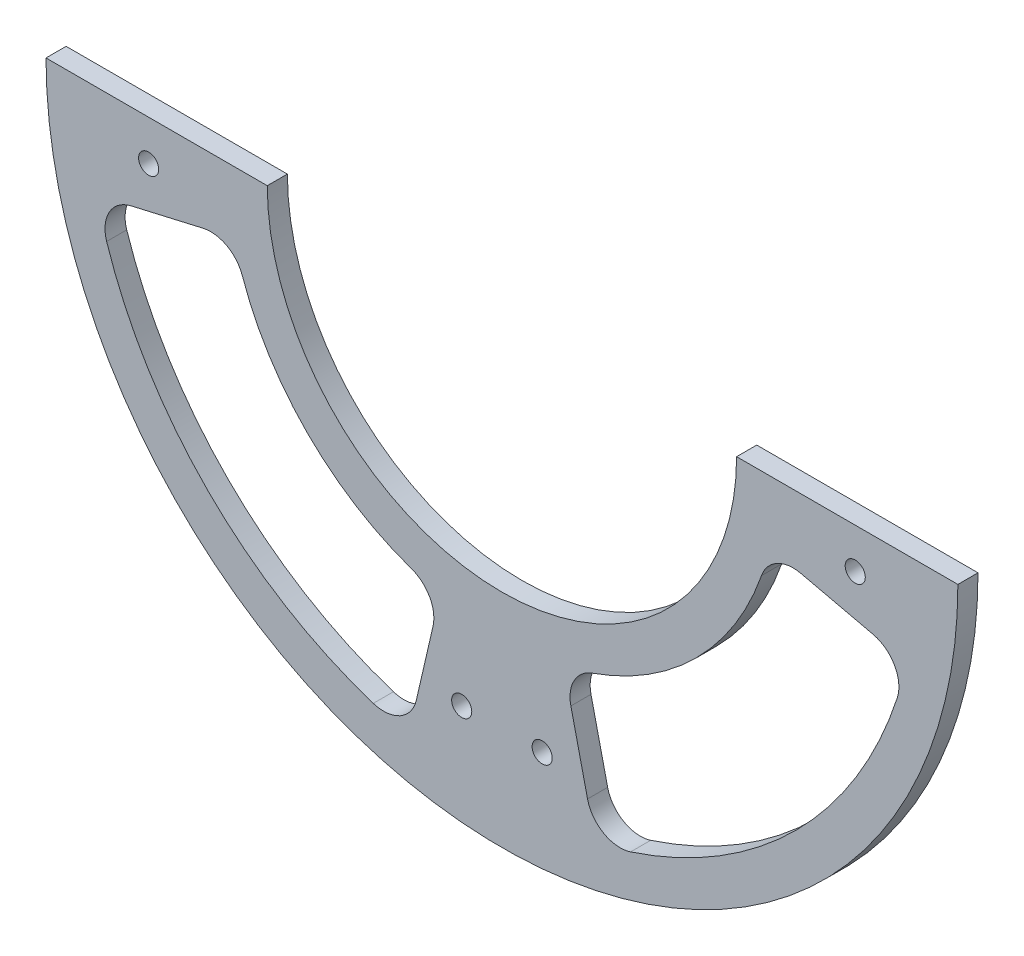
ISO-10303-21;
HEADER;
FILE_DESCRIPTION(('STEP AP214'),'2;1');
FILE_NAME('part.step','',(''),(''),'','','');
FILE_SCHEMA(('AUTOMOTIVE_DESIGN { 1 0 10303 214 1 1 1 1 }'));
ENDSEC;
DATA;
#1=APPLICATION_CONTEXT('core data for automotive mechanical design processes');
#2=APPLICATION_PROTOCOL_DEFINITION('international standard','automotive_design',2000,#1);
#3=PRODUCT_CONTEXT('',#1,'mechanical');
#4=PRODUCT('Part','Part','',(#3));
#5=PRODUCT_RELATED_PRODUCT_CATEGORY('part','',(#4));
#6=PRODUCT_DEFINITION_FORMATION('','',#4);
#7=PRODUCT_DEFINITION_CONTEXT('part definition',#1,'design');
#8=PRODUCT_DEFINITION('design','',#6,#7);
#9=PRODUCT_DEFINITION_SHAPE('','',#8);
#10=(LENGTH_UNIT() NAMED_UNIT(*) SI_UNIT(.MILLI.,.METRE.));
#11=(NAMED_UNIT(*) PLANE_ANGLE_UNIT() SI_UNIT($,.RADIAN.));
#12=(NAMED_UNIT(*) SI_UNIT($,.STERADIAN.) SOLID_ANGLE_UNIT());
#13=UNCERTAINTY_MEASURE_WITH_UNIT(LENGTH_MEASURE(1.E-05),#10,'distance_accuracy_value','');
#14=(GEOMETRIC_REPRESENTATION_CONTEXT(3) GLOBAL_UNCERTAINTY_ASSIGNED_CONTEXT((#13)) GLOBAL_UNIT_ASSIGNED_CONTEXT((#10,
#11,#12)) REPRESENTATION_CONTEXT('',''));
#15=CARTESIAN_POINT('',(0.,0.,0.));
#16=DIRECTION('',(0.,0.,1.));
#17=DIRECTION('',(1.,0.,0.));
#18=AXIS2_PLACEMENT_3D('',#15,#16,#17);
#19=CARTESIAN_POINT('',(1.10140146269985,2.65337625104963,3.));
#20=DIRECTION('',(0.,0.,1.));
#21=DIRECTION('',(1.,0.,0.));
#22=AXIS2_PLACEMENT_3D('',#19,#20,#21);
#23=PLANE('',#22);
#24=CARTESIAN_POINT('',(1.10140146269985,2.65337625104963,3.));
#25=DIRECTION('',(0.,0.,-1.));
#26=DIRECTION('',(1.,0.,0.));
#27=AXIS2_PLACEMENT_3D('',#24,#25,#26);
#28=CIRCLE('',#27,41.);
#29=CARTESIAN_POINT('',(39.8130026100056,-10.852620069545,3.));
#30=VERTEX_POINT('',#29);
#31=CARTESIAN_POINT('',(14.6073977832945,-36.0582248962561,3.));
#32=VERTEX_POINT('',#31);
#33=EDGE_CURVE('E439',#30,#32,#28,.T.);
#34=ORIENTED_EDGE('',*,*,#33,.F.);
#35=CARTESIAN_POINT('',(44.5339295791893,-12.4996927915687,3.));
#36=DIRECTION('',(0.,0.,1.));
#37=DIRECTION('',(1.,0.,0.));
#38=AXIS2_PLACEMENT_3D('',#35,#36,#37);
#39=CIRCLE('',#38,5.);
#40=CARTESIAN_POINT('',(45.6580992834676,-7.62770731581216,3.));
#41=VERTEX_POINT('',#40);
#42=EDGE_CURVE('E241',#30,#41,#39,.F.);
#43=ORIENTED_EDGE('',*,*,#42,.T.);
#44=DIRECTION('',(-0.974397095151311,0.22483394085566,0.));
#45=VECTOR('',#44,1.);
#46=CARTESIAN_POINT('',(41.0516823639036,-6.56481532403244,3.));
#47=LINE('',#46,#45);
#48=CARTESIAN_POINT('',(56.4279396672789,-10.1127574744467,3.));
#49=VERTEX_POINT('',#48);
#50=EDGE_CURVE('E415',#49,#41,#47,.T.);
#51=ORIENTED_EDGE('',*,*,#50,.F.);
#52=CARTESIAN_POINT('',(55.3037699630006,-14.9847429502032,3.));
#53=DIRECTION('',(0.,0.,1.));
#54=DIRECTION('',(1.,0.,0.));
#55=AXIS2_PLACEMENT_3D('',#52,#53,#54);
#56=CIRCLE('',#55,5.);
#57=CARTESIAN_POINT('',(60.0583636910972,-16.5319463889096,3.));
#58=VERTEX_POINT('',#57);
#59=EDGE_CURVE('E245',#49,#58,#56,.F.);
#60=ORIENTED_EDGE('',*,*,#59,.T.);
#61=CARTESIAN_POINT('',(1.10140146269985,2.65337625104963,3.));
#62=DIRECTION('',(0.,0.,1.));
#63=DIRECTION('',(1.,0.,0.));
#64=AXIS2_PLACEMENT_3D('',#61,#62,#63);
#65=CIRCLE('',#64,62.);
#66=CARTESIAN_POINT('',(20.2867241026591,-56.3035859773477,3.));
#67=VERTEX_POINT('',#66);
#68=EDGE_CURVE('E421',#67,#58,#65,.T.);
#69=ORIENTED_EDGE('',*,*,#68,.F.);
#70=CARTESIAN_POINT('',(18.7395206639527,-51.5489922492511,3.));
#71=DIRECTION('',(0.,0.,1.));
#72=DIRECTION('',(1.,0.,0.));
#73=AXIS2_PLACEMENT_3D('',#70,#71,#72);
#74=CIRCLE('',#73,5.);
#75=CARTESIAN_POINT('',(13.8675351881961,-52.6731619535294,3.));
#76=VERTEX_POINT('',#75);
#77=EDGE_CURVE('E249',#67,#76,#74,.F.);
#78=ORIENTED_EDGE('',*,*,#77,.T.);
#79=DIRECTION('',(0.22483394085566,-0.974397095151311,0.));
#80=VECTOR('',#79,1.);
#81=CARTESIAN_POINT('',(10.3195930377819,-37.2969046501541,3.));
#82=LINE('',#81,#80);
#83=CARTESIAN_POINT('',(11.3824850295616,-41.9033215697181,3.));
#84=VERTEX_POINT('',#83);
#85=EDGE_CURVE('E441',#84,#76,#82,.T.);
#86=ORIENTED_EDGE('',*,*,#85,.F.);
#87=CARTESIAN_POINT('',(16.2544705053182,-40.7791518654398,3.));
#88=DIRECTION('',(0.,0.,1.));
#89=DIRECTION('',(1.,0.,0.));
#90=AXIS2_PLACEMENT_3D('',#87,#88,#89);
#91=CIRCLE('',#90,5.);
#92=EDGE_CURVE('E253',#84,#32,#91,.F.);
#93=ORIENTED_EDGE('',*,*,#92,.T.);
#94=EDGE_LOOP('',(#34,#43,#51,#60,#69,#78,#86,#93));
#95=FACE_BOUND('',#94,.T.);
#96=CARTESIAN_POINT('',(1.10140146269985,2.65337625104963,3.));
#97=DIRECTION('',(0.,0.,-1.));
#98=DIRECTION('',(1.,0.,0.));
#99=AXIS2_PLACEMENT_3D('',#96,#97,#98);
#100=CIRCLE('',#99,41.);
#101=CARTESIAN_POINT('',(-12.4045948578948,-36.0582248962561,3.));
#102=VERTEX_POINT('',#101);
#103=CARTESIAN_POINT('',(-37.6101996846059,-10.852620069545,3.));
#104=VERTEX_POINT('',#103);
#105=EDGE_CURVE('E273',#102,#104,#100,.T.);
#106=ORIENTED_EDGE('',*,*,#105,.F.);
#107=CARTESIAN_POINT('',(-14.0516675799185,-40.7791518654398,3.));
#108=DIRECTION('',(0.,0.,1.));
#109=DIRECTION('',(1.,0.,0.));
#110=AXIS2_PLACEMENT_3D('',#107,#108,#109);
#111=CIRCLE('',#110,5.);
#112=CARTESIAN_POINT('',(-9.17968210416194,-41.9033215697181,3.));
#113=VERTEX_POINT('',#112);
#114=EDGE_CURVE('E261',#102,#113,#111,.F.);
#115=ORIENTED_EDGE('',*,*,#114,.T.);
#116=DIRECTION('',(0.22483394085566,0.974397095151311,0.));
#117=VECTOR('',#116,1.);
#118=CARTESIAN_POINT('',(-8.11679011238222,-37.2969046501541,3.));
#119=LINE('',#118,#117);
#120=CARTESIAN_POINT('',(-11.6647322627964,-52.6731619535294,3.));
#121=VERTEX_POINT('',#120);
#122=EDGE_CURVE('E293',#121,#113,#119,.T.);
#123=ORIENTED_EDGE('',*,*,#122,.F.);
#124=CARTESIAN_POINT('',(-16.536717738553,-51.5489922492511,3.));
#125=DIRECTION('',(0.,0.,1.));
#126=DIRECTION('',(1.,0.,0.));
#127=AXIS2_PLACEMENT_3D('',#124,#125,#126);
#128=CIRCLE('',#127,5.);
#129=CARTESIAN_POINT('',(-18.0839211772594,-56.3035859773477,3.));
#130=VERTEX_POINT('',#129);
#131=EDGE_CURVE('E257',#121,#130,#128,.F.);
#132=ORIENTED_EDGE('',*,*,#131,.T.);
#133=CARTESIAN_POINT('',(1.10140146269985,2.65337625104963,3.));
#134=DIRECTION('',(0.,0.,1.));
#135=DIRECTION('',(1.,0.,0.));
#136=AXIS2_PLACEMENT_3D('',#133,#134,#135);
#137=CIRCLE('',#136,62.);
#138=CARTESIAN_POINT('',(-57.8555607656975,-16.5319463889096,3.));
#139=VERTEX_POINT('',#138);
#140=EDGE_CURVE('E301',#139,#130,#137,.T.);
#141=ORIENTED_EDGE('',*,*,#140,.F.);
#142=CARTESIAN_POINT('',(-53.1009670376009,-14.9847429502032,3.));
#143=DIRECTION('',(0.,0.,1.));
#144=DIRECTION('',(1.,0.,0.));
#145=AXIS2_PLACEMENT_3D('',#142,#143,#144);
#146=CIRCLE('',#145,5.);
#147=CARTESIAN_POINT('',(-54.2251367418792,-10.1127574744467,3.));
#148=VERTEX_POINT('',#147);
#149=EDGE_CURVE('E265',#139,#148,#146,.F.);
#150=ORIENTED_EDGE('',*,*,#149,.T.);
#151=DIRECTION('',(-0.974397095151311,-0.22483394085566,0.));
#152=VECTOR('',#151,1.);
#153=CARTESIAN_POINT('',(-38.8488794385039,-6.56481532403245,3.));
#154=LINE('',#153,#152);
#155=CARTESIAN_POINT('',(-43.4552963580678,-7.62770731581217,3.));
#156=VERTEX_POINT('',#155);
#157=EDGE_CURVE('E274',#156,#148,#154,.T.);
#158=ORIENTED_EDGE('',*,*,#157,.F.);
#159=CARTESIAN_POINT('',(-42.3311266537895,-12.4996927915687,3.));
#160=DIRECTION('',(0.,0.,1.));
#161=DIRECTION('',(1.,0.,0.));
#162=AXIS2_PLACEMENT_3D('',#159,#160,#161);
#163=CIRCLE('',#162,5.);
#164=EDGE_CURVE('E43',#156,#104,#163,.F.);
#165=ORIENTED_EDGE('',*,*,#164,.T.);
#166=EDGE_LOOP('',(#106,#115,#123,#132,#141,#150,#158,#165));
#167=FACE_BOUND('',#166,.T.);
#168=CARTESIAN_POINT('',(7.10140146269986,-50.0360999277852,3.));
#169=DIRECTION('',(0.,0.,1.));
#170=DIRECTION('',(1.,0.,0.));
#171=AXIS2_PLACEMENT_3D('',#168,#169,#170);
#172=CIRCLE('',#171,1.5);
#173=CARTESIAN_POINT('',(8.60140146269986,-50.0360999277852,3.));
#174=VERTEX_POINT('',#173);
#175=EDGE_CURVE('E312',#174,#174,#172,.T.);
#176=ORIENTED_EDGE('',*,*,#175,.F.);
#177=EDGE_LOOP('',(#176));
#178=FACE_BOUND('',#177,.T.);
#179=CARTESIAN_POINT('',(-51.5880747161349,-3.34662374895037,3.));
#180=DIRECTION('',(0.,0.,1.));
#181=DIRECTION('',(1.,0.,0.));
#182=AXIS2_PLACEMENT_3D('',#179,#180,#181);
#183=CIRCLE('',#182,1.5);
#184=CARTESIAN_POINT('',(-50.0880747161349,-3.34662374895037,3.));
#185=VERTEX_POINT('',#184);
#186=EDGE_CURVE('E324',#185,#185,#183,.T.);
#187=ORIENTED_EDGE('',*,*,#186,.F.);
#188=EDGE_LOOP('',(#187));
#189=FACE_BOUND('',#188,.T.);
#190=CARTESIAN_POINT('',(1.10140146269985,2.65337625104963,3.));
#191=DIRECTION('',(0.,0.,-1.));
#192=DIRECTION('',(1.,0.,0.));
#193=AXIS2_PLACEMENT_3D('',#190,#191,#192);
#194=CIRCLE('',#193,35.);
#195=CARTESIAN_POINT('',(36.1014014626999,2.65337625104963,3.));
#196=VERTEX_POINT('',#195);
#197=CARTESIAN_POINT('',(-33.8985985373002,2.65337625104963,3.));
#198=VERTEX_POINT('',#197);
#199=EDGE_CURVE('E183',#196,#198,#194,.T.);
#200=ORIENTED_EDGE('',*,*,#199,.T.);
#201=DIRECTION('',(-1.,0.,0.));
#202=VECTOR('',#201,1.);
#203=CARTESIAN_POINT('',(-66.8985985373001,2.65337625104963,3.));
#204=LINE('',#203,#202);
#205=CARTESIAN_POINT('',(-66.8985985373001,2.65337625104964,3.));
#206=VERTEX_POINT('',#205);
#207=EDGE_CURVE('E172',#198,#206,#204,.T.);
#208=ORIENTED_EDGE('',*,*,#207,.T.);
#209=CARTESIAN_POINT('',(1.10140146269985,2.65337625104963,3.));
#210=DIRECTION('',(0.,0.,1.));
#211=DIRECTION('',(1.,0.,0.));
#212=AXIS2_PLACEMENT_3D('',#209,#210,#211);
#213=CIRCLE('',#212,68.);
#214=CARTESIAN_POINT('',(69.1014014626999,2.65337625104963,3.));
#215=VERTEX_POINT('',#214);
#216=EDGE_CURVE('E182',#206,#215,#213,.T.);
#217=ORIENTED_EDGE('',*,*,#216,.T.);
#218=DIRECTION('',(-1.,0.,0.));
#219=VECTOR('',#218,1.);
#220=CARTESIAN_POINT('',(36.1014014626999,2.65337625104963,3.));
#221=LINE('',#220,#219);
#222=EDGE_CURVE('E188',#215,#196,#221,.T.);
#223=ORIENTED_EDGE('',*,*,#222,.T.);
#224=EDGE_LOOP('',(#200,#208,#217,#223));
#225=FACE_BOUND('',#224,.T.);
#226=CARTESIAN_POINT('',(-4.89859853730014,-50.0360999277852,3.));
#227=DIRECTION('',(0.,0.,1.));
#228=DIRECTION('',(1.,0.,0.));
#229=AXIS2_PLACEMENT_3D('',#226,#227,#228);
#230=CIRCLE('',#229,1.5);
#231=CARTESIAN_POINT('',(-3.39859853730014,-50.0360999277852,3.));
#232=VERTEX_POINT('',#231);
#233=EDGE_CURVE('E318',#232,#232,#230,.T.);
#234=ORIENTED_EDGE('',*,*,#233,.F.);
#235=EDGE_LOOP('',(#234));
#236=FACE_BOUND('',#235,.T.);
#237=CARTESIAN_POINT('',(53.7908776415346,-3.34662374895037,3.));
#238=DIRECTION('',(0.,0.,1.));
#239=DIRECTION('',(1.,0.,0.));
#240=AXIS2_PLACEMENT_3D('',#237,#238,#239);
#241=CIRCLE('',#240,1.5);
#242=CARTESIAN_POINT('',(55.2908776415347,-3.34662374895037,3.));
#243=VERTEX_POINT('',#242);
#244=EDGE_CURVE('E306',#243,#243,#241,.T.);
#245=ORIENTED_EDGE('',*,*,#244,.F.);
#246=EDGE_LOOP('',(#245));
#247=FACE_BOUND('',#246,.T.);
#248=ADVANCED_FACE('F35',(#95,#167,#178,#189,#225,#236,#247),#23,.T.);
#249=CARTESIAN_POINT('',(1.10140146269985,2.65337625104963,0.));
#250=DIRECTION('',(0.,0.,1.));
#251=DIRECTION('',(1.,0.,0.));
#252=AXIS2_PLACEMENT_3D('',#249,#250,#251);
#253=PLANE('',#252);
#254=CARTESIAN_POINT('',(1.10140146269985,2.65337625104963,0.));
#255=DIRECTION('',(0.,0.,1.));
#256=DIRECTION('',(1.,0.,0.));
#257=AXIS2_PLACEMENT_3D('',#254,#255,#256);
#258=CIRCLE('',#257,62.);
#259=CARTESIAN_POINT('',(20.2867241026591,-56.3035859773477,0.));
#260=VERTEX_POINT('',#259);
#261=CARTESIAN_POINT('',(60.0583636910972,-16.5319463889096,0.));
#262=VERTEX_POINT('',#261);
#263=EDGE_CURVE('E434',#260,#262,#258,.T.);
#264=ORIENTED_EDGE('',*,*,#263,.T.);
#265=CARTESIAN_POINT('',(55.3037699630006,-14.9847429502032,0.));
#266=DIRECTION('',(0.,0.,1.));
#267=DIRECTION('',(1.,0.,0.));
#268=AXIS2_PLACEMENT_3D('',#265,#266,#267);
#269=CIRCLE('',#268,5.);
#270=CARTESIAN_POINT('',(56.4279396672789,-10.1127574744467,0.));
#271=VERTEX_POINT('',#270);
#272=EDGE_CURVE('E247',#262,#271,#269,.T.);
#273=ORIENTED_EDGE('',*,*,#272,.T.);
#274=DIRECTION('',(-0.974397095151311,0.22483394085566,0.));
#275=VECTOR('',#274,1.);
#276=CARTESIAN_POINT('',(41.0516823639036,-6.56481532403244,0.));
#277=LINE('',#276,#275);
#278=CARTESIAN_POINT('',(45.6580992834676,-7.62770731581216,0.));
#279=VERTEX_POINT('',#278);
#280=EDGE_CURVE('E282',#271,#279,#277,.T.);
#281=ORIENTED_EDGE('',*,*,#280,.T.);
#282=CARTESIAN_POINT('',(44.5339295791893,-12.4996927915687,0.));
#283=DIRECTION('',(0.,0.,1.));
#284=DIRECTION('',(1.,0.,0.));
#285=AXIS2_PLACEMENT_3D('',#282,#283,#284);
#286=CIRCLE('',#285,5.);
#287=CARTESIAN_POINT('',(39.8130026100056,-10.852620069545,0.));
#288=VERTEX_POINT('',#287);
#289=EDGE_CURVE('E243',#279,#288,#286,.T.);
#290=ORIENTED_EDGE('',*,*,#289,.T.);
#291=CARTESIAN_POINT('',(1.10140146269985,2.65337625104963,0.));
#292=DIRECTION('',(0.,0.,-1.));
#293=DIRECTION('',(1.,0.,0.));
#294=AXIS2_PLACEMENT_3D('',#291,#292,#293);
#295=CIRCLE('',#294,41.);
#296=CARTESIAN_POINT('',(14.6073977832945,-36.0582248962561,0.));
#297=VERTEX_POINT('',#296);
#298=EDGE_CURVE('E420',#288,#297,#295,.T.);
#299=ORIENTED_EDGE('',*,*,#298,.T.);
#300=CARTESIAN_POINT('',(16.2544705053182,-40.7791518654398,0.));
#301=DIRECTION('',(0.,0.,1.));
#302=DIRECTION('',(1.,0.,0.));
#303=AXIS2_PLACEMENT_3D('',#300,#301,#302);
#304=CIRCLE('',#303,5.);
#305=CARTESIAN_POINT('',(11.3824850295616,-41.9033215697181,0.));
#306=VERTEX_POINT('',#305);
#307=EDGE_CURVE('E255',#297,#306,#304,.T.);
#308=ORIENTED_EDGE('',*,*,#307,.T.);
#309=DIRECTION('',(0.22483394085566,-0.974397095151311,0.));
#310=VECTOR('',#309,1.);
#311=CARTESIAN_POINT('',(10.3195930377819,-37.2969046501541,0.));
#312=LINE('',#311,#310);
#313=CARTESIAN_POINT('',(13.8675351881961,-52.6731619535294,0.));
#314=VERTEX_POINT('',#313);
#315=EDGE_CURVE('E431',#306,#314,#312,.T.);
#316=ORIENTED_EDGE('',*,*,#315,.T.);
#317=CARTESIAN_POINT('',(18.7395206639527,-51.5489922492511,0.));
#318=DIRECTION('',(0.,0.,1.));
#319=DIRECTION('',(1.,0.,0.));
#320=AXIS2_PLACEMENT_3D('',#317,#318,#319);
#321=CIRCLE('',#320,5.);
#322=EDGE_CURVE('E251',#314,#260,#321,.T.);
#323=ORIENTED_EDGE('',*,*,#322,.T.);
#324=EDGE_LOOP('',(#264,#273,#281,#290,#299,#308,#316,#323));
#325=FACE_BOUND('',#324,.T.);
#326=CARTESIAN_POINT('',(1.10140146269985,2.65337625104963,0.));
#327=DIRECTION('',(0.,0.,1.));
#328=DIRECTION('',(1.,0.,0.));
#329=AXIS2_PLACEMENT_3D('',#326,#327,#328);
#330=CIRCLE('',#329,62.);
#331=CARTESIAN_POINT('',(-57.8555607656975,-16.5319463889096,0.));
#332=VERTEX_POINT('',#331);
#333=CARTESIAN_POINT('',(-18.0839211772594,-56.3035859773477,0.));
#334=VERTEX_POINT('',#333);
#335=EDGE_CURVE('E287',#332,#334,#330,.T.);
#336=ORIENTED_EDGE('',*,*,#335,.T.);
#337=CARTESIAN_POINT('',(-16.536717738553,-51.5489922492511,0.));
#338=DIRECTION('',(0.,0.,1.));
#339=DIRECTION('',(1.,0.,0.));
#340=AXIS2_PLACEMENT_3D('',#337,#338,#339);
#341=CIRCLE('',#340,5.);
#342=CARTESIAN_POINT('',(-11.6647322627964,-52.6731619535294,0.));
#343=VERTEX_POINT('',#342);
#344=EDGE_CURVE('E259',#334,#343,#341,.T.);
#345=ORIENTED_EDGE('',*,*,#344,.T.);
#346=DIRECTION('',(0.22483394085566,0.974397095151311,0.));
#347=VECTOR('',#346,1.);
#348=CARTESIAN_POINT('',(-8.11679011238222,-37.2969046501541,0.));
#349=LINE('',#348,#347);
#350=CARTESIAN_POINT('',(-9.17968210416194,-41.9033215697181,0.));
#351=VERTEX_POINT('',#350);
#352=EDGE_CURVE('E291',#343,#351,#349,.T.);
#353=ORIENTED_EDGE('',*,*,#352,.T.);
#354=CARTESIAN_POINT('',(-14.0516675799185,-40.7791518654398,0.));
#355=DIRECTION('',(0.,0.,1.));
#356=DIRECTION('',(1.,0.,0.));
#357=AXIS2_PLACEMENT_3D('',#354,#355,#356);
#358=CIRCLE('',#357,5.);
#359=CARTESIAN_POINT('',(-12.4045948578948,-36.0582248962561,0.));
#360=VERTEX_POINT('',#359);
#361=EDGE_CURVE('E263',#351,#360,#358,.T.);
#362=ORIENTED_EDGE('',*,*,#361,.T.);
#363=CARTESIAN_POINT('',(1.10140146269985,2.65337625104963,0.));
#364=DIRECTION('',(0.,0.,-1.));
#365=DIRECTION('',(1.,0.,0.));
#366=AXIS2_PLACEMENT_3D('',#363,#364,#365);
#367=CIRCLE('',#366,41.);
#368=CARTESIAN_POINT('',(-37.6101996846059,-10.852620069545,0.));
#369=VERTEX_POINT('',#368);
#370=EDGE_CURVE('E288',#360,#369,#367,.T.);
#371=ORIENTED_EDGE('',*,*,#370,.T.);
#372=CARTESIAN_POINT('',(-42.3311266537895,-12.4996927915687,0.));
#373=DIRECTION('',(0.,0.,1.));
#374=DIRECTION('',(1.,0.,0.));
#375=AXIS2_PLACEMENT_3D('',#372,#373,#374);
#376=CIRCLE('',#375,5.);
#377=CARTESIAN_POINT('',(-43.4552963580678,-7.62770731581217,0.));
#378=VERTEX_POINT('',#377);
#379=EDGE_CURVE('E11',#369,#378,#376,.T.);
#380=ORIENTED_EDGE('',*,*,#379,.T.);
#381=DIRECTION('',(-0.974397095151311,-0.22483394085566,0.));
#382=VECTOR('',#381,1.);
#383=CARTESIAN_POINT('',(-38.8488794385039,-6.56481532403245,0.));
#384=LINE('',#383,#382);
#385=CARTESIAN_POINT('',(-54.2251367418792,-10.1127574744467,0.));
#386=VERTEX_POINT('',#385);
#387=EDGE_CURVE('E285',#378,#386,#384,.T.);
#388=ORIENTED_EDGE('',*,*,#387,.T.);
#389=CARTESIAN_POINT('',(-53.1009670376009,-14.9847429502032,0.));
#390=DIRECTION('',(0.,0.,1.));
#391=DIRECTION('',(1.,0.,0.));
#392=AXIS2_PLACEMENT_3D('',#389,#390,#391);
#393=CIRCLE('',#392,5.);
#394=EDGE_CURVE('E267',#386,#332,#393,.T.);
#395=ORIENTED_EDGE('',*,*,#394,.T.);
#396=EDGE_LOOP('',(#336,#345,#353,#362,#371,#380,#388,#395));
#397=FACE_BOUND('',#396,.T.);
#398=CARTESIAN_POINT('',(1.10140146269985,2.65337625104963,0.));
#399=DIRECTION('',(0.,0.,-1.));
#400=DIRECTION('',(1.,0.,0.));
#401=AXIS2_PLACEMENT_3D('',#398,#399,#400);
#402=CIRCLE('',#401,35.);
#403=CARTESIAN_POINT('',(36.1014014626999,2.65337625104963,0.));
#404=VERTEX_POINT('',#403);
#405=CARTESIAN_POINT('',(-33.8985985373002,2.65337625104963,0.));
#406=VERTEX_POINT('',#405);
#407=EDGE_CURVE('E196',#404,#406,#402,.T.);
#408=ORIENTED_EDGE('',*,*,#407,.F.);
#409=DIRECTION('',(-1.,0.,0.));
#410=VECTOR('',#409,1.);
#411=CARTESIAN_POINT('',(36.1014014626999,2.65337625104963,0.));
#412=LINE('',#411,#410);
#413=CARTESIAN_POINT('',(69.1014014626999,2.65337625104963,0.));
#414=VERTEX_POINT('',#413);
#415=EDGE_CURVE('E192',#414,#404,#412,.T.);
#416=ORIENTED_EDGE('',*,*,#415,.F.);
#417=CARTESIAN_POINT('',(1.10140146269985,2.65337625104963,0.));
#418=DIRECTION('',(0.,0.,1.));
#419=DIRECTION('',(1.,0.,0.));
#420=AXIS2_PLACEMENT_3D('',#417,#418,#419);
#421=CIRCLE('',#420,68.);
#422=CARTESIAN_POINT('',(-66.8985985373001,2.65337625104964,0.));
#423=VERTEX_POINT('',#422);
#424=EDGE_CURVE('E335',#423,#414,#421,.T.);
#425=ORIENTED_EDGE('',*,*,#424,.F.);
#426=DIRECTION('',(-1.,0.,0.));
#427=VECTOR('',#426,1.);
#428=CARTESIAN_POINT('',(-66.8985985373001,2.65337625104963,0.));
#429=LINE('',#428,#427);
#430=EDGE_CURVE('E333',#406,#423,#429,.T.);
#431=ORIENTED_EDGE('',*,*,#430,.F.);
#432=EDGE_LOOP('',(#408,#416,#425,#431));
#433=FACE_BOUND('',#432,.T.);
#434=CARTESIAN_POINT('',(-51.5880747161349,-3.34662374895037,0.));
#435=DIRECTION('',(0.,0.,1.));
#436=DIRECTION('',(1.,0.,0.));
#437=AXIS2_PLACEMENT_3D('',#434,#435,#436);
#438=CIRCLE('',#437,1.5);
#439=CARTESIAN_POINT('',(-50.0880747161349,-3.34662374895037,0.));
#440=VERTEX_POINT('',#439);
#441=EDGE_CURVE('E321',#440,#440,#438,.T.);
#442=ORIENTED_EDGE('',*,*,#441,.T.);
#443=EDGE_LOOP('',(#442));
#444=FACE_BOUND('',#443,.T.);
#445=CARTESIAN_POINT('',(-4.89859853730014,-50.0360999277852,0.));
#446=DIRECTION('',(0.,0.,1.));
#447=DIRECTION('',(1.,0.,0.));
#448=AXIS2_PLACEMENT_3D('',#445,#446,#447);
#449=CIRCLE('',#448,1.5);
#450=CARTESIAN_POINT('',(-3.39859853730014,-50.0360999277852,0.));
#451=VERTEX_POINT('',#450);
#452=EDGE_CURVE('E315',#451,#451,#449,.T.);
#453=ORIENTED_EDGE('',*,*,#452,.T.);
#454=EDGE_LOOP('',(#453));
#455=FACE_BOUND('',#454,.T.);
#456=CARTESIAN_POINT('',(7.10140146269986,-50.0360999277852,0.));
#457=DIRECTION('',(0.,0.,1.));
#458=DIRECTION('',(1.,0.,0.));
#459=AXIS2_PLACEMENT_3D('',#456,#457,#458);
#460=CIRCLE('',#459,1.5);
#461=CARTESIAN_POINT('',(8.60140146269986,-50.0360999277852,0.));
#462=VERTEX_POINT('',#461);
#463=EDGE_CURVE('E309',#462,#462,#460,.T.);
#464=ORIENTED_EDGE('',*,*,#463,.T.);
#465=EDGE_LOOP('',(#464));
#466=FACE_BOUND('',#465,.T.);
#467=CARTESIAN_POINT('',(53.7908776415346,-3.34662374895037,0.));
#468=DIRECTION('',(0.,0.,1.));
#469=DIRECTION('',(1.,0.,0.));
#470=AXIS2_PLACEMENT_3D('',#467,#468,#469);
#471=CIRCLE('',#470,1.5);
#472=CARTESIAN_POINT('',(55.2908776415347,-3.34662374895037,0.));
#473=VERTEX_POINT('',#472);
#474=EDGE_CURVE('E298',#473,#473,#471,.T.);
#475=ORIENTED_EDGE('',*,*,#474,.T.);
#476=EDGE_LOOP('',(#475));
#477=FACE_BOUND('',#476,.T.);
#478=ADVANCED_FACE('F346',(#325,#397,#433,#444,#455,#466,#477),#253,.F.);
#479=CARTESIAN_POINT('',(1.10140146269985,2.65337625104963,3.));
#480=DIRECTION('',(0.,0.,-1.));
#481=DIRECTION('',(-1.,0.,0.));
#482=AXIS2_PLACEMENT_3D('',#479,#480,#481);
#483=CYLINDRICAL_SURFACE('',#482,35.);
#484=ORIENTED_EDGE('',*,*,#407,.T.);
#485=DIRECTION('',(0.,0.,-1.));
#486=VECTOR('',#485,1.);
#487=CARTESIAN_POINT('',(-33.8985985373002,2.65337625104963,3.));
#488=LINE('',#487,#486);
#489=EDGE_CURVE('E176',#198,#406,#488,.T.);
#490=ORIENTED_EDGE('',*,*,#489,.F.);
#491=ORIENTED_EDGE('',*,*,#199,.F.);
#492=DIRECTION('',(0.,0.,-1.));
#493=VECTOR('',#492,1.);
#494=CARTESIAN_POINT('',(36.1014014626999,2.65337625104963,3.));
#495=LINE('',#494,#493);
#496=EDGE_CURVE('E331',#196,#404,#495,.T.);
#497=ORIENTED_EDGE('',*,*,#496,.T.);
#498=EDGE_LOOP('',(#484,#490,#491,#497));
#499=FACE_BOUND('',#498,.T.);
#500=ADVANCED_FACE('F194',(#499),#483,.F.);
#501=CARTESIAN_POINT('',(-66.8985985373001,2.65337625104963,3.));
#502=DIRECTION('',(0.,-1.,0.));
#503=DIRECTION('',(0.,0.,-1.));
#504=AXIS2_PLACEMENT_3D('',#501,#502,#503);
#505=PLANE('',#504);
#506=ORIENTED_EDGE('',*,*,#430,.T.);
#507=DIRECTION('',(0.,0.,-1.));
#508=VECTOR('',#507,1.);
#509=CARTESIAN_POINT('',(-66.8985985373001,2.65337625104964,3.));
#510=LINE('',#509,#508);
#511=EDGE_CURVE('E179',#206,#423,#510,.T.);
#512=ORIENTED_EDGE('',*,*,#511,.F.);
#513=ORIENTED_EDGE('',*,*,#207,.F.);
#514=ORIENTED_EDGE('',*,*,#489,.T.);
#515=EDGE_LOOP('',(#506,#512,#513,#514));
#516=FACE_BOUND('',#515,.T.);
#517=ADVANCED_FACE('F174',(#516),#505,.F.);
#518=CARTESIAN_POINT('',(1.10140146269985,2.65337625104963,3.));
#519=DIRECTION('',(0.,0.,-1.));
#520=DIRECTION('',(-1.,0.,0.));
#521=AXIS2_PLACEMENT_3D('',#518,#519,#520);
#522=CYLINDRICAL_SURFACE('',#521,68.);
#523=ORIENTED_EDGE('',*,*,#424,.T.);
#524=DIRECTION('',(0.,0.,-1.));
#525=VECTOR('',#524,1.);
#526=CARTESIAN_POINT('',(69.1014014626999,2.65337625104963,3.));
#527=LINE('',#526,#525);
#528=EDGE_CURVE('E201',#215,#414,#527,.T.);
#529=ORIENTED_EDGE('',*,*,#528,.F.);
#530=ORIENTED_EDGE('',*,*,#216,.F.);
#531=ORIENTED_EDGE('',*,*,#511,.T.);
#532=EDGE_LOOP('',(#523,#529,#530,#531));
#533=FACE_BOUND('',#532,.T.);
#534=ADVANCED_FACE('F348',(#533),#522,.T.);
#535=CARTESIAN_POINT('',(36.1014014626999,2.65337625104963,3.));
#536=DIRECTION('',(0.,-1.,0.));
#537=DIRECTION('',(0.,0.,-1.));
#538=AXIS2_PLACEMENT_3D('',#535,#536,#537);
#539=PLANE('',#538);
#540=ORIENTED_EDGE('',*,*,#415,.T.);
#541=ORIENTED_EDGE('',*,*,#496,.F.);
#542=ORIENTED_EDGE('',*,*,#222,.F.);
#543=ORIENTED_EDGE('',*,*,#528,.T.);
#544=EDGE_LOOP('',(#540,#541,#542,#543));
#545=FACE_BOUND('',#544,.T.);
#546=ADVANCED_FACE('F342',(#545),#539,.F.);
#547=CARTESIAN_POINT('',(-51.5880747161349,-3.34662374895037,3.));
#548=DIRECTION('',(0.,0.,-1.));
#549=DIRECTION('',(-1.,0.,0.));
#550=AXIS2_PLACEMENT_3D('',#547,#548,#549);
#551=CYLINDRICAL_SURFACE('',#550,1.5);
#552=ORIENTED_EDGE('',*,*,#186,.T.);
#553=EDGE_LOOP('',(#552));
#554=FACE_BOUND('',#553,.T.);
#555=ORIENTED_EDGE('',*,*,#441,.F.);
#556=EDGE_LOOP('',(#555));
#557=FACE_BOUND('',#556,.T.);
#558=ADVANCED_FACE('F355',(#554,#557),#551,.F.);
#559=CARTESIAN_POINT('',(-4.89859853730014,-50.0360999277852,3.));
#560=DIRECTION('',(0.,0.,-1.));
#561=DIRECTION('',(-1.,0.,0.));
#562=AXIS2_PLACEMENT_3D('',#559,#560,#561);
#563=CYLINDRICAL_SURFACE('',#562,1.5);
#564=ORIENTED_EDGE('',*,*,#233,.T.);
#565=EDGE_LOOP('',(#564));
#566=FACE_BOUND('',#565,.T.);
#567=ORIENTED_EDGE('',*,*,#452,.F.);
#568=EDGE_LOOP('',(#567));
#569=FACE_BOUND('',#568,.T.);
#570=ADVANCED_FACE('F370',(#566,#569),#563,.F.);
#571=CARTESIAN_POINT('',(7.10140146269986,-50.0360999277852,3.));
#572=DIRECTION('',(0.,0.,-1.));
#573=DIRECTION('',(-1.,0.,0.));
#574=AXIS2_PLACEMENT_3D('',#571,#572,#573);
#575=CYLINDRICAL_SURFACE('',#574,1.5);
#576=ORIENTED_EDGE('',*,*,#175,.T.);
#577=EDGE_LOOP('',(#576));
#578=FACE_BOUND('',#577,.T.);
#579=ORIENTED_EDGE('',*,*,#463,.F.);
#580=EDGE_LOOP('',(#579));
#581=FACE_BOUND('',#580,.T.);
#582=ADVANCED_FACE('F374',(#578,#581),#575,.F.);
#583=CARTESIAN_POINT('',(53.7908776415346,-3.34662374895037,3.));
#584=DIRECTION('',(0.,0.,-1.));
#585=DIRECTION('',(-1.,0.,0.));
#586=AXIS2_PLACEMENT_3D('',#583,#584,#585);
#587=CYLINDRICAL_SURFACE('',#586,1.5);
#588=ORIENTED_EDGE('',*,*,#244,.T.);
#589=EDGE_LOOP('',(#588));
#590=FACE_BOUND('',#589,.T.);
#591=ORIENTED_EDGE('',*,*,#474,.F.);
#592=EDGE_LOOP('',(#591));
#593=FACE_BOUND('',#592,.T.);
#594=ADVANCED_FACE('F378',(#590,#593),#587,.F.);
#595=CARTESIAN_POINT('',(1.10140146269985,2.65337625104963,0.));
#596=DIRECTION('',(0.,0.,1.));
#597=DIRECTION('',(1.,0.,0.));
#598=AXIS2_PLACEMENT_3D('',#595,#596,#597);
#599=CYLINDRICAL_SURFACE('',#598,41.);
#600=ORIENTED_EDGE('',*,*,#370,.F.);
#601=DIRECTION('',(0.,0.,1.));
#602=VECTOR('',#601,1.);
#603=CARTESIAN_POINT('',(-12.4045948578948,-36.0582248962561,0.));
#604=LINE('',#603,#602);
#605=EDGE_CURVE('E234',#360,#102,#604,.T.);
#606=ORIENTED_EDGE('',*,*,#605,.T.);
#607=ORIENTED_EDGE('',*,*,#105,.T.);
#608=DIRECTION('',(0.,0.,1.));
#609=VECTOR('',#608,1.);
#610=CARTESIAN_POINT('',(-37.6101996846059,-10.852620069545,0.));
#611=LINE('',#610,#609);
#612=EDGE_CURVE('E232',#104,#369,#611,.F.);
#613=ORIENTED_EDGE('',*,*,#612,.T.);
#614=EDGE_LOOP('',(#600,#606,#607,#613));
#615=FACE_BOUND('',#614,.T.);
#616=ADVANCED_FACE('F280',(#615),#599,.T.);
#617=CARTESIAN_POINT('',(-8.11679011238222,-37.2969046501541,0.));
#618=DIRECTION('',(0.974397095151311,-0.22483394085566,0.));
#619=DIRECTION('',(0.22483394085566,0.974397095151311,0.));
#620=AXIS2_PLACEMENT_3D('',#617,#618,#619);
#621=PLANE('',#620);
#622=ORIENTED_EDGE('',*,*,#352,.F.);
#623=DIRECTION('',(0.,0.,-1.));
#624=VECTOR('',#623,1.);
#625=CARTESIAN_POINT('',(-11.6647322627964,-52.6731619535294,3.));
#626=LINE('',#625,#624);
#627=EDGE_CURVE('E224',#343,#121,#626,.F.);
#628=ORIENTED_EDGE('',*,*,#627,.T.);
#629=ORIENTED_EDGE('',*,*,#122,.T.);
#630=DIRECTION('',(0.,0.,-1.));
#631=VECTOR('',#630,1.);
#632=CARTESIAN_POINT('',(-9.17968210416194,-41.9033215697181,0.));
#633=LINE('',#632,#631);
#634=EDGE_CURVE('E222',#113,#351,#633,.T.);
#635=ORIENTED_EDGE('',*,*,#634,.T.);
#636=EDGE_LOOP('',(#622,#628,#629,#635));
#637=FACE_BOUND('',#636,.T.);
#638=ADVANCED_FACE('F385',(#637),#621,.F.);
#639=CARTESIAN_POINT('',(1.10140146269985,2.65337625104963,0.));
#640=DIRECTION('',(0.,0.,1.));
#641=DIRECTION('',(1.,0.,0.));
#642=AXIS2_PLACEMENT_3D('',#639,#640,#641);
#643=CYLINDRICAL_SURFACE('',#642,62.);
#644=ORIENTED_EDGE('',*,*,#140,.T.);
#645=DIRECTION('',(0.,0.,1.));
#646=VECTOR('',#645,1.);
#647=CARTESIAN_POINT('',(-18.0839211772594,-56.3035859773477,0.));
#648=LINE('',#647,#646);
#649=EDGE_CURVE('E230',#130,#334,#648,.F.);
#650=ORIENTED_EDGE('',*,*,#649,.T.);
#651=ORIENTED_EDGE('',*,*,#335,.F.);
#652=DIRECTION('',(0.,0.,1.));
#653=VECTOR('',#652,1.);
#654=CARTESIAN_POINT('',(-57.8555607656975,-16.5319463889096,0.));
#655=LINE('',#654,#653);
#656=EDGE_CURVE('E227',#332,#139,#655,.T.);
#657=ORIENTED_EDGE('',*,*,#656,.T.);
#658=EDGE_LOOP('',(#644,#650,#651,#657));
#659=FACE_BOUND('',#658,.T.);
#660=ADVANCED_FACE('F389',(#659),#643,.F.);
#661=CARTESIAN_POINT('',(-38.8488794385039,-6.56481532403245,0.));
#662=DIRECTION('',(-0.22483394085566,0.974397095151311,0.));
#663=DIRECTION('',(-0.974397095151311,-0.22483394085566,0.));
#664=AXIS2_PLACEMENT_3D('',#661,#662,#663);
#665=PLANE('',#664);
#666=ORIENTED_EDGE('',*,*,#157,.T.);
#667=DIRECTION('',(0.,0.,-1.));
#668=VECTOR('',#667,1.);
#669=CARTESIAN_POINT('',(-54.2251367418792,-10.1127574744467,0.));
#670=LINE('',#669,#668);
#671=EDGE_CURVE('E50',#148,#386,#670,.T.);
#672=ORIENTED_EDGE('',*,*,#671,.T.);
#673=ORIENTED_EDGE('',*,*,#387,.F.);
#674=DIRECTION('',(0.,0.,-1.));
#675=VECTOR('',#674,1.);
#676=CARTESIAN_POINT('',(-43.4552963580678,-7.62770731581217,3.));
#677=LINE('',#676,#675);
#678=EDGE_CURVE('E237',#378,#156,#677,.F.);
#679=ORIENTED_EDGE('',*,*,#678,.T.);
#680=EDGE_LOOP('',(#666,#672,#673,#679));
#681=FACE_BOUND('',#680,.T.);
#682=ADVANCED_FACE('F284',(#681),#665,.F.);
#683=CARTESIAN_POINT('',(1.10140146269985,2.65337625104963,0.));
#684=DIRECTION('',(0.,0.,1.));
#685=DIRECTION('',(1.,0.,0.));
#686=AXIS2_PLACEMENT_3D('',#683,#684,#685);
#687=CYLINDRICAL_SURFACE('',#686,41.);
#688=ORIENTED_EDGE('',*,*,#298,.F.);
#689=DIRECTION('',(0.,0.,1.));
#690=VECTOR('',#689,1.);
#691=CARTESIAN_POINT('',(39.8130026100056,-10.852620069545,0.));
#692=LINE('',#691,#690);
#693=EDGE_CURVE('E199',#288,#30,#692,.T.);
#694=ORIENTED_EDGE('',*,*,#693,.T.);
#695=ORIENTED_EDGE('',*,*,#33,.T.);
#696=DIRECTION('',(0.,0.,1.));
#697=VECTOR('',#696,1.);
#698=CARTESIAN_POINT('',(14.6073977832945,-36.0582248962561,0.));
#699=LINE('',#698,#697);
#700=EDGE_CURVE('E197',#32,#297,#699,.F.);
#701=ORIENTED_EDGE('',*,*,#700,.T.);
#702=EDGE_LOOP('',(#688,#694,#695,#701));
#703=FACE_BOUND('',#702,.T.);
#704=ADVANCED_FACE('F388',(#703),#687,.T.);
#705=CARTESIAN_POINT('',(41.0516823639036,-6.56481532403244,0.));
#706=DIRECTION('',(0.22483394085566,0.974397095151311,0.));
#707=DIRECTION('',(-0.974397095151311,0.22483394085566,0.));
#708=AXIS2_PLACEMENT_3D('',#705,#706,#707);
#709=PLANE('',#708);
#710=ORIENTED_EDGE('',*,*,#50,.T.);
#711=DIRECTION('',(0.,0.,-1.));
#712=VECTOR('',#711,1.);
#713=CARTESIAN_POINT('',(45.6580992834676,-7.62770731581216,0.));
#714=LINE('',#713,#712);
#715=EDGE_CURVE('E210',#41,#279,#714,.T.);
#716=ORIENTED_EDGE('',*,*,#715,.T.);
#717=ORIENTED_EDGE('',*,*,#280,.F.);
#718=DIRECTION('',(0.,0.,-1.));
#719=VECTOR('',#718,1.);
#720=CARTESIAN_POINT('',(56.4279396672789,-10.1127574744466,3.));
#721=LINE('',#720,#719);
#722=EDGE_CURVE('E207',#271,#49,#721,.F.);
#723=ORIENTED_EDGE('',*,*,#722,.T.);
#724=EDGE_LOOP('',(#710,#716,#717,#723));
#725=FACE_BOUND('',#724,.T.);
#726=ADVANCED_FACE('F398',(#725),#709,.F.);
#727=CARTESIAN_POINT('',(1.10140146269985,2.65337625104963,0.));
#728=DIRECTION('',(0.,0.,1.));
#729=DIRECTION('',(1.,0.,0.));
#730=AXIS2_PLACEMENT_3D('',#727,#728,#729);
#731=CYLINDRICAL_SURFACE('',#730,62.);
#732=ORIENTED_EDGE('',*,*,#68,.T.);
#733=DIRECTION('',(0.,0.,1.));
#734=VECTOR('',#733,1.);
#735=CARTESIAN_POINT('',(60.0583636910972,-16.5319463889096,0.));
#736=LINE('',#735,#734);
#737=EDGE_CURVE('E215',#58,#262,#736,.F.);
#738=ORIENTED_EDGE('',*,*,#737,.T.);
#739=ORIENTED_EDGE('',*,*,#263,.F.);
#740=DIRECTION('',(0.,0.,1.));
#741=VECTOR('',#740,1.);
#742=CARTESIAN_POINT('',(20.2867241026591,-56.3035859773477,0.));
#743=LINE('',#742,#741);
#744=EDGE_CURVE('E212',#260,#67,#743,.T.);
#745=ORIENTED_EDGE('',*,*,#744,.T.);
#746=EDGE_LOOP('',(#732,#738,#739,#745));
#747=FACE_BOUND('',#746,.T.);
#748=ADVANCED_FACE('F404',(#747),#731,.F.);
#749=CARTESIAN_POINT('',(10.3195930377819,-37.2969046501541,0.));
#750=DIRECTION('',(-0.974397095151311,-0.22483394085566,0.));
#751=DIRECTION('',(0.22483394085566,-0.974397095151311,0.));
#752=AXIS2_PLACEMENT_3D('',#749,#750,#751);
#753=PLANE('',#752);
#754=ORIENTED_EDGE('',*,*,#85,.T.);
#755=DIRECTION('',(0.,0.,-1.));
#756=VECTOR('',#755,1.);
#757=CARTESIAN_POINT('',(13.8675351881961,-52.6731619535294,0.));
#758=LINE('',#757,#756);
#759=EDGE_CURVE('E220',#76,#314,#758,.T.);
#760=ORIENTED_EDGE('',*,*,#759,.T.);
#761=ORIENTED_EDGE('',*,*,#315,.F.);
#762=DIRECTION('',(0.,0.,-1.));
#763=VECTOR('',#762,1.);
#764=CARTESIAN_POINT('',(11.3824850295616,-41.9033215697181,3.));
#765=LINE('',#764,#763);
#766=EDGE_CURVE('E217',#306,#84,#765,.F.);
#767=ORIENTED_EDGE('',*,*,#766,.T.);
#768=EDGE_LOOP('',(#754,#760,#761,#767));
#769=FACE_BOUND('',#768,.T.);
#770=ADVANCED_FACE('F400',(#769),#753,.F.);
#771=CARTESIAN_POINT('',(44.5339295791893,-12.4996927915687,0.));
#772=DIRECTION('',(0.,0.,1.));
#773=DIRECTION('',(1.,0.,0.));
#774=AXIS2_PLACEMENT_3D('',#771,#772,#773);
#775=CYLINDRICAL_SURFACE('',#774,5.);
#776=ORIENTED_EDGE('',*,*,#289,.F.);
#777=ORIENTED_EDGE('',*,*,#715,.F.);
#778=ORIENTED_EDGE('',*,*,#42,.F.);
#779=ORIENTED_EDGE('',*,*,#693,.F.);
#780=EDGE_LOOP('',(#776,#777,#778,#779));
#781=FACE_BOUND('',#780,.T.);
#782=ADVANCED_FACE('F403',(#781),#775,.F.);
#783=CARTESIAN_POINT('',(55.3037699630006,-14.9847429502032,0.));
#784=DIRECTION('',(0.,0.,1.));
#785=DIRECTION('',(1.,0.,0.));
#786=AXIS2_PLACEMENT_3D('',#783,#784,#785);
#787=CYLINDRICAL_SURFACE('',#786,5.);
#788=ORIENTED_EDGE('',*,*,#272,.F.);
#789=ORIENTED_EDGE('',*,*,#737,.F.);
#790=ORIENTED_EDGE('',*,*,#59,.F.);
#791=ORIENTED_EDGE('',*,*,#722,.F.);
#792=EDGE_LOOP('',(#788,#789,#790,#791));
#793=FACE_BOUND('',#792,.T.);
#794=ADVANCED_FACE('F451',(#793),#787,.F.);
#795=CARTESIAN_POINT('',(18.7395206639527,-51.5489922492511,0.));
#796=DIRECTION('',(0.,0.,1.));
#797=DIRECTION('',(1.,0.,0.));
#798=AXIS2_PLACEMENT_3D('',#795,#796,#797);
#799=CYLINDRICAL_SURFACE('',#798,5.);
#800=ORIENTED_EDGE('',*,*,#322,.F.);
#801=ORIENTED_EDGE('',*,*,#759,.F.);
#802=ORIENTED_EDGE('',*,*,#77,.F.);
#803=ORIENTED_EDGE('',*,*,#744,.F.);
#804=EDGE_LOOP('',(#800,#801,#802,#803));
#805=FACE_BOUND('',#804,.T.);
#806=ADVANCED_FACE('F454',(#805),#799,.F.);
#807=CARTESIAN_POINT('',(16.2544705053182,-40.7791518654398,0.));
#808=DIRECTION('',(0.,0.,1.));
#809=DIRECTION('',(1.,0.,0.));
#810=AXIS2_PLACEMENT_3D('',#807,#808,#809);
#811=CYLINDRICAL_SURFACE('',#810,5.);
#812=ORIENTED_EDGE('',*,*,#307,.F.);
#813=ORIENTED_EDGE('',*,*,#700,.F.);
#814=ORIENTED_EDGE('',*,*,#92,.F.);
#815=ORIENTED_EDGE('',*,*,#766,.F.);
#816=EDGE_LOOP('',(#812,#813,#814,#815));
#817=FACE_BOUND('',#816,.T.);
#818=ADVANCED_FACE('F460',(#817),#811,.F.);
#819=CARTESIAN_POINT('',(-16.536717738553,-51.5489922492511,0.));
#820=DIRECTION('',(0.,0.,1.));
#821=DIRECTION('',(1.,0.,0.));
#822=AXIS2_PLACEMENT_3D('',#819,#820,#821);
#823=CYLINDRICAL_SURFACE('',#822,5.);
#824=ORIENTED_EDGE('',*,*,#344,.F.);
#825=ORIENTED_EDGE('',*,*,#649,.F.);
#826=ORIENTED_EDGE('',*,*,#131,.F.);
#827=ORIENTED_EDGE('',*,*,#627,.F.);
#828=EDGE_LOOP('',(#824,#825,#826,#827));
#829=FACE_BOUND('',#828,.T.);
#830=ADVANCED_FACE('F462',(#829),#823,.F.);
#831=CARTESIAN_POINT('',(-14.0516675799185,-40.7791518654398,0.));
#832=DIRECTION('',(0.,0.,1.));
#833=DIRECTION('',(1.,0.,0.));
#834=AXIS2_PLACEMENT_3D('',#831,#832,#833);
#835=CYLINDRICAL_SURFACE('',#834,5.);
#836=ORIENTED_EDGE('',*,*,#361,.F.);
#837=ORIENTED_EDGE('',*,*,#634,.F.);
#838=ORIENTED_EDGE('',*,*,#114,.F.);
#839=ORIENTED_EDGE('',*,*,#605,.F.);
#840=EDGE_LOOP('',(#836,#837,#838,#839));
#841=FACE_BOUND('',#840,.T.);
#842=ADVANCED_FACE('F468',(#841),#835,.F.);
#843=CARTESIAN_POINT('',(-53.1009670376009,-14.9847429502032,0.));
#844=DIRECTION('',(0.,0.,1.));
#845=DIRECTION('',(1.,0.,0.));
#846=AXIS2_PLACEMENT_3D('',#843,#844,#845);
#847=CYLINDRICAL_SURFACE('',#846,5.);
#848=ORIENTED_EDGE('',*,*,#394,.F.);
#849=ORIENTED_EDGE('',*,*,#671,.F.);
#850=ORIENTED_EDGE('',*,*,#149,.F.);
#851=ORIENTED_EDGE('',*,*,#656,.F.);
#852=EDGE_LOOP('',(#848,#849,#850,#851));
#853=FACE_BOUND('',#852,.T.);
#854=ADVANCED_FACE('F475',(#853),#847,.F.);
#855=CARTESIAN_POINT('',(-42.3311266537895,-12.4996927915687,0.));
#856=DIRECTION('',(0.,0.,1.));
#857=DIRECTION('',(1.,0.,0.));
#858=AXIS2_PLACEMENT_3D('',#855,#856,#857);
#859=CYLINDRICAL_SURFACE('',#858,5.);
#860=ORIENTED_EDGE('',*,*,#379,.F.);
#861=ORIENTED_EDGE('',*,*,#612,.F.);
#862=ORIENTED_EDGE('',*,*,#164,.F.);
#863=ORIENTED_EDGE('',*,*,#678,.F.);
#864=EDGE_LOOP('',(#860,#861,#862,#863));
#865=FACE_BOUND('',#864,.T.);
#866=ADVANCED_FACE('F37',(#865),#859,.F.);
#867=CLOSED_SHELL('',(#248,#478,#500,#517,#534,#546,#558,#570,#582,#594,#616,#638,#660,#682,
#704,#726,#748,#770,#782,#794,#806,#818,#830,#842,#854,#866));
#868=MANIFOLD_SOLID_BREP('B2',#867);
#869=ADVANCED_BREP_SHAPE_REPRESENTATION('',(#18,#868),#14);
#870=SHAPE_DEFINITION_REPRESENTATION(#9,#869);
ENDSEC;
END-ISO-10303-21;
